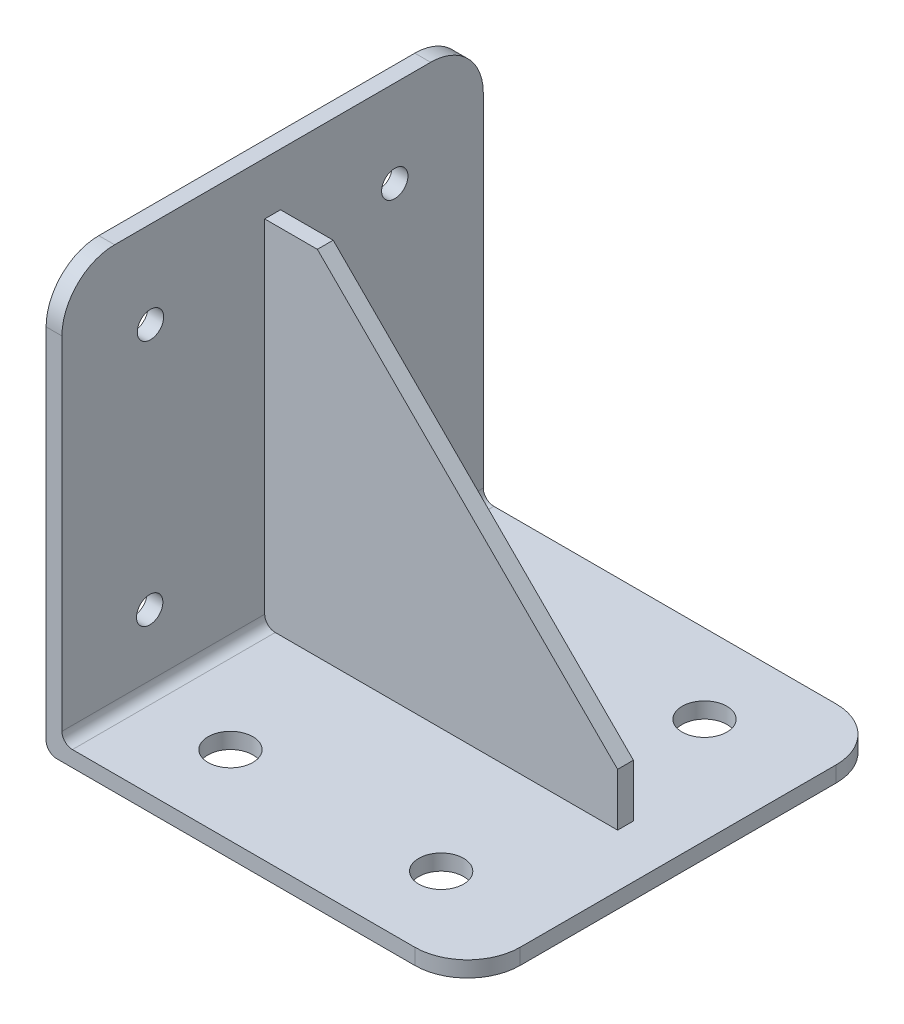
ISO-10303-21;
HEADER;
FILE_DESCRIPTION(('STEP AP214'),'2;1');
FILE_NAME('part.step','',(''),(''),'','','');
FILE_SCHEMA(('AUTOMOTIVE_DESIGN { 1 0 10303 214 1 1 1 1 }'));
ENDSEC;
DATA;
#1=APPLICATION_CONTEXT('core data for automotive mechanical design processes');
#2=APPLICATION_PROTOCOL_DEFINITION('international standard','automotive_design',2000,#1);
#3=PRODUCT_CONTEXT('',#1,'mechanical');
#4=PRODUCT('Part','Part','',(#3));
#5=PRODUCT_RELATED_PRODUCT_CATEGORY('part','',(#4));
#6=PRODUCT_DEFINITION_FORMATION('','',#4);
#7=PRODUCT_DEFINITION_CONTEXT('part definition',#1,'design');
#8=PRODUCT_DEFINITION('design','',#6,#7);
#9=PRODUCT_DEFINITION_SHAPE('','',#8);
#10=(LENGTH_UNIT() NAMED_UNIT(*) SI_UNIT(.MILLI.,.METRE.));
#11=(NAMED_UNIT(*) PLANE_ANGLE_UNIT() SI_UNIT($,.RADIAN.));
#12=(NAMED_UNIT(*) SI_UNIT($,.STERADIAN.) SOLID_ANGLE_UNIT());
#13=UNCERTAINTY_MEASURE_WITH_UNIT(LENGTH_MEASURE(1.E-05),#10,'distance_accuracy_value','');
#14=(GEOMETRIC_REPRESENTATION_CONTEXT(3) GLOBAL_UNCERTAINTY_ASSIGNED_CONTEXT((#13)) GLOBAL_UNIT_ASSIGNED_CONTEXT((#10,
#11,#12)) REPRESENTATION_CONTEXT('',''));
#15=CARTESIAN_POINT('',(0.,0.,0.));
#16=DIRECTION('',(0.,0.,1.));
#17=DIRECTION('',(1.,0.,0.));
#18=AXIS2_PLACEMENT_3D('',#15,#16,#17);
#19=CARTESIAN_POINT('',(-42.,45.,1.5));
#20=DIRECTION('',(0.707106781186548,0.707106781186548,0.));
#21=DIRECTION('',(-0.707106781186548,0.707106781186548,0.));
#22=AXIS2_PLACEMENT_3D('',#19,#20,#21);
#23=PLANE('',#22);
#24=DIRECTION('',(0.707106781186547,-0.707106781186548,0.));
#25=VECTOR('',#24,1.);
#26=CARTESIAN_POINT('',(-27.,30.,1.5));
#27=LINE('',#26,#25);
#28=CARTESIAN_POINT('',(-27.,30.,1.5));
#29=VERTEX_POINT('',#28);
#30=CARTESIAN_POINT('',(30.,-27.,1.5));
#31=VERTEX_POINT('',#30);
#32=EDGE_CURVE('E271',#29,#31,#27,.T.);
#33=ORIENTED_EDGE('',*,*,#32,.T.);
#34=DIRECTION('',(0.,0.,1.));
#35=VECTOR('',#34,1.);
#36=CARTESIAN_POINT('',(30.,-27.,-8.5));
#37=LINE('',#36,#35);
#38=CARTESIAN_POINT('',(30.,-27.,-1.5));
#39=VERTEX_POINT('',#38);
#40=EDGE_CURVE('E311',#31,#39,#37,.F.);
#41=ORIENTED_EDGE('',*,*,#40,.T.);
#42=DIRECTION('',(-0.707106781186547,0.707106781186548,0.));
#43=VECTOR('',#42,1.);
#44=CARTESIAN_POINT('',(30.,-27.,-1.5));
#45=LINE('',#44,#43);
#46=CARTESIAN_POINT('',(-27.,30.,-1.5));
#47=VERTEX_POINT('',#46);
#48=EDGE_CURVE('E308',#39,#47,#45,.T.);
#49=ORIENTED_EDGE('',*,*,#48,.T.);
#50=DIRECTION('',(0.,0.,-1.));
#51=VECTOR('',#50,1.);
#52=CARTESIAN_POINT('',(-27.,30.,-8.5));
#53=LINE('',#52,#51);
#54=EDGE_CURVE('E272',#47,#29,#53,.F.);
#55=ORIENTED_EDGE('',*,*,#54,.T.);
#56=EDGE_LOOP('',(#33,#41,#49,#55));
#57=FACE_BOUND('',#56,.T.);
#58=ADVANCED_FACE('F16',(#57),#23,.T.);
#59=CARTESIAN_POINT('',(30.,-37.,-8.5));
#60=DIRECTION('',(-1.,0.,0.));
#61=DIRECTION('',(0.,0.,1.));
#62=AXIS2_PLACEMENT_3D('',#59,#60,#61);
#63=PLANE('',#62);
#64=DIRECTION('',(0.,0.,-1.));
#65=VECTOR('',#64,1.);
#66=CARTESIAN_POINT('',(30.,-37.,-40.));
#67=LINE('',#66,#65);
#68=CARTESIAN_POINT('',(30.,-37.,1.5));
#69=VERTEX_POINT('',#68);
#70=CARTESIAN_POINT('',(30.,-37.,-1.5));
#71=VERTEX_POINT('',#70);
#72=EDGE_CURVE('E240',#69,#71,#67,.T.);
#73=ORIENTED_EDGE('',*,*,#72,.T.);
#74=DIRECTION('',(0.,1.,0.));
#75=VECTOR('',#74,1.);
#76=CARTESIAN_POINT('',(30.,-37.,-1.5));
#77=LINE('',#76,#75);
#78=EDGE_CURVE('E119',#71,#39,#77,.T.);
#79=ORIENTED_EDGE('',*,*,#78,.T.);
#80=ORIENTED_EDGE('',*,*,#40,.F.);
#81=DIRECTION('',(0.,1.,0.));
#82=VECTOR('',#81,1.);
#83=CARTESIAN_POINT('',(30.,-37.,1.5));
#84=LINE('',#83,#82);
#85=EDGE_CURVE('E291',#31,#69,#84,.F.);
#86=ORIENTED_EDGE('',*,*,#85,.T.);
#87=EDGE_LOOP('',(#73,#79,#80,#86));
#88=FACE_BOUND('',#87,.T.);
#89=ADVANCED_FACE('F455',(#88),#63,.F.);
#90=CARTESIAN_POINT('',(40.,40.,40.));
#91=DIRECTION('',(-1.,0.,0.));
#92=DIRECTION('',(0.,0.,1.));
#93=AXIS2_PLACEMENT_3D('',#90,#91,#92);
#94=PLANE('',#93);
#95=DIRECTION('',(0.,0.,1.));
#96=VECTOR('',#95,1.);
#97=CARTESIAN_POINT('',(40.,-40.,40.));
#98=LINE('',#97,#96);
#99=CARTESIAN_POINT('',(40.,-40.,30.));
#100=VERTEX_POINT('',#99);
#101=CARTESIAN_POINT('',(40.,-40.,-30.));
#102=VERTEX_POINT('',#101);
#103=EDGE_CURVE('E220',#100,#102,#98,.F.);
#104=ORIENTED_EDGE('',*,*,#103,.T.);
#105=DIRECTION('',(0.,1.,0.));
#106=VECTOR('',#105,1.);
#107=CARTESIAN_POINT('',(40.,40.,-30.));
#108=LINE('',#107,#106);
#109=CARTESIAN_POINT('',(40.,-37.,-30.));
#110=VERTEX_POINT('',#109);
#111=EDGE_CURVE('E289',#110,#102,#108,.F.);
#112=ORIENTED_EDGE('',*,*,#111,.F.);
#113=DIRECTION('',(0.,0.,-1.));
#114=VECTOR('',#113,1.);
#115=CARTESIAN_POINT('',(40.,-37.,-40.));
#116=LINE('',#115,#114);
#117=CARTESIAN_POINT('',(40.,-37.,30.));
#118=VERTEX_POINT('',#117);
#119=EDGE_CURVE('E244',#110,#118,#116,.F.);
#120=ORIENTED_EDGE('',*,*,#119,.T.);
#121=DIRECTION('',(0.,-1.,0.));
#122=VECTOR('',#121,1.);
#123=CARTESIAN_POINT('',(40.,-40.,30.));
#124=LINE('',#123,#122);
#125=EDGE_CURVE('E255',#100,#118,#124,.F.);
#126=ORIENTED_EDGE('',*,*,#125,.F.);
#127=EDGE_LOOP('',(#104,#112,#120,#126));
#128=FACE_BOUND('',#127,.T.);
#129=ADVANCED_FACE('F439',(#128),#94,.F.);
#130=CARTESIAN_POINT('',(20.,-40.,25.));
#131=DIRECTION('',(0.,1.,0.));
#132=DIRECTION('',(0.,0.,1.));
#133=AXIS2_PLACEMENT_3D('',#130,#131,#132);
#134=CYLINDRICAL_SURFACE('',#133,4.25);
#135=CARTESIAN_POINT('',(20.,-37.,25.));
#136=DIRECTION('',(0.,1.,0.));
#137=DIRECTION('',(0.,0.,1.));
#138=AXIS2_PLACEMENT_3D('',#135,#136,#137);
#139=CIRCLE('',#138,4.25);
#140=CARTESIAN_POINT('',(20.,-37.,29.25));
#141=VERTEX_POINT('',#140);
#142=EDGE_CURVE('E231',#141,#141,#139,.T.);
#143=ORIENTED_EDGE('',*,*,#142,.T.);
#144=EDGE_LOOP('',(#143));
#145=FACE_BOUND('',#144,.T.);
#146=CARTESIAN_POINT('',(20.,-40.,25.));
#147=DIRECTION('',(0.,1.,0.));
#148=DIRECTION('',(0.,0.,1.));
#149=AXIS2_PLACEMENT_3D('',#146,#147,#148);
#150=CIRCLE('',#149,4.25);
#151=CARTESIAN_POINT('',(20.,-40.,29.25));
#152=VERTEX_POINT('',#151);
#153=EDGE_CURVE('E215',#152,#152,#150,.F.);
#154=ORIENTED_EDGE('',*,*,#153,.T.);
#155=EDGE_LOOP('',(#154));
#156=FACE_BOUND('',#155,.T.);
#157=ADVANCED_FACE('F461',(#145,#156),#134,.F.);
#158=CARTESIAN_POINT('',(20.,-40.,-25.));
#159=DIRECTION('',(0.,1.,0.));
#160=DIRECTION('',(0.,0.,1.));
#161=AXIS2_PLACEMENT_3D('',#158,#159,#160);
#162=CYLINDRICAL_SURFACE('',#161,4.25);
#163=CARTESIAN_POINT('',(20.,-37.,-25.));
#164=DIRECTION('',(0.,1.,0.));
#165=DIRECTION('',(0.,0.,1.));
#166=AXIS2_PLACEMENT_3D('',#163,#164,#165);
#167=CIRCLE('',#166,4.25);
#168=CARTESIAN_POINT('',(20.,-37.,-20.75));
#169=VERTEX_POINT('',#168);
#170=EDGE_CURVE('E237',#169,#169,#167,.T.);
#171=ORIENTED_EDGE('',*,*,#170,.T.);
#172=EDGE_LOOP('',(#171));
#173=FACE_BOUND('',#172,.T.);
#174=CARTESIAN_POINT('',(20.,-40.,-25.));
#175=DIRECTION('',(0.,1.,0.));
#176=DIRECTION('',(0.,0.,1.));
#177=AXIS2_PLACEMENT_3D('',#174,#175,#176);
#178=CIRCLE('',#177,4.25);
#179=CARTESIAN_POINT('',(20.,-40.,-20.75));
#180=VERTEX_POINT('',#179);
#181=EDGE_CURVE('E212',#180,#180,#178,.F.);
#182=ORIENTED_EDGE('',*,*,#181,.T.);
#183=EDGE_LOOP('',(#182));
#184=FACE_BOUND('',#183,.T.);
#185=ADVANCED_FACE('F466',(#173,#184),#162,.F.);
#186=CARTESIAN_POINT('',(-20.,-40.,25.));
#187=DIRECTION('',(0.,1.,0.));
#188=DIRECTION('',(0.,0.,1.));
#189=AXIS2_PLACEMENT_3D('',#186,#187,#188);
#190=CYLINDRICAL_SURFACE('',#189,4.25);
#191=CARTESIAN_POINT('',(-20.,-37.,25.));
#192=DIRECTION('',(0.,1.,0.));
#193=DIRECTION('',(0.,0.,1.));
#194=AXIS2_PLACEMENT_3D('',#191,#192,#193);
#195=CIRCLE('',#194,4.25);
#196=CARTESIAN_POINT('',(-20.,-37.,29.25));
#197=VERTEX_POINT('',#196);
#198=EDGE_CURVE('E228',#197,#197,#195,.T.);
#199=ORIENTED_EDGE('',*,*,#198,.T.);
#200=EDGE_LOOP('',(#199));
#201=FACE_BOUND('',#200,.T.);
#202=CARTESIAN_POINT('',(-20.,-40.,25.));
#203=DIRECTION('',(0.,1.,0.));
#204=DIRECTION('',(0.,0.,1.));
#205=AXIS2_PLACEMENT_3D('',#202,#203,#204);
#206=CIRCLE('',#205,4.25);
#207=CARTESIAN_POINT('',(-20.,-40.,29.25));
#208=VERTEX_POINT('',#207);
#209=EDGE_CURVE('E209',#208,#208,#206,.F.);
#210=ORIENTED_EDGE('',*,*,#209,.T.);
#211=EDGE_LOOP('',(#210));
#212=FACE_BOUND('',#211,.T.);
#213=ADVANCED_FACE('F470',(#201,#212),#190,.F.);
#214=CARTESIAN_POINT('',(-20.,-40.,-25.));
#215=DIRECTION('',(0.,1.,0.));
#216=DIRECTION('',(0.,0.,1.));
#217=AXIS2_PLACEMENT_3D('',#214,#215,#216);
#218=CYLINDRICAL_SURFACE('',#217,4.25);
#219=CARTESIAN_POINT('',(-20.,-37.,-25.));
#220=DIRECTION('',(0.,1.,0.));
#221=DIRECTION('',(0.,0.,1.));
#222=AXIS2_PLACEMENT_3D('',#219,#220,#221);
#223=CIRCLE('',#222,4.25);
#224=CARTESIAN_POINT('',(-20.,-37.,-20.75));
#225=VERTEX_POINT('',#224);
#226=EDGE_CURVE('E234',#225,#225,#223,.T.);
#227=ORIENTED_EDGE('',*,*,#226,.T.);
#228=EDGE_LOOP('',(#227));
#229=FACE_BOUND('',#228,.T.);
#230=CARTESIAN_POINT('',(-20.,-40.,-25.));
#231=DIRECTION('',(0.,1.,0.));
#232=DIRECTION('',(0.,0.,1.));
#233=AXIS2_PLACEMENT_3D('',#230,#231,#232);
#234=CIRCLE('',#233,4.25);
#235=CARTESIAN_POINT('',(-20.,-40.,-20.75));
#236=VERTEX_POINT('',#235);
#237=EDGE_CURVE('E205',#236,#236,#234,.F.);
#238=ORIENTED_EDGE('',*,*,#237,.T.);
#239=EDGE_LOOP('',(#238));
#240=FACE_BOUND('',#239,.T.);
#241=ADVANCED_FACE('F474',(#229,#240),#218,.F.);
#242=CARTESIAN_POINT('',(60.,-37.,-1.5));
#243=DIRECTION('',(0.,0.,1.));
#244=DIRECTION('',(1.,0.,0.));
#245=AXIS2_PLACEMENT_3D('',#242,#243,#244);
#246=PLANE('',#245);
#247=DIRECTION('',(1.,0.,0.));
#248=VECTOR('',#247,1.);
#249=CARTESIAN_POINT('',(40.,-37.,-1.5));
#250=LINE('',#249,#248);
#251=CARTESIAN_POINT('',(-35.,-37.,-1.5));
#252=VERTEX_POINT('',#251);
#253=EDGE_CURVE('E252',#71,#252,#250,.F.);
#254=ORIENTED_EDGE('',*,*,#253,.T.);
#255=CARTESIAN_POINT('',(-35.,-35.,-1.5));
#256=DIRECTION('',(0.,0.,-1.));
#257=DIRECTION('',(-1.,0.,0.));
#258=AXIS2_PLACEMENT_3D('',#255,#256,#257);
#259=CIRCLE('',#258,2.);
#260=CARTESIAN_POINT('',(-37.,-35.,-1.5));
#261=VERTEX_POINT('',#260);
#262=EDGE_CURVE('E19',#252,#261,#259,.T.);
#263=ORIENTED_EDGE('',*,*,#262,.T.);
#264=DIRECTION('',(0.,1.,0.));
#265=VECTOR('',#264,1.);
#266=CARTESIAN_POINT('',(-37.,40.,-1.5));
#267=LINE('',#266,#265);
#268=CARTESIAN_POINT('',(-37.,30.,-1.5));
#269=VERTEX_POINT('',#268);
#270=EDGE_CURVE('E277',#261,#269,#267,.T.);
#271=ORIENTED_EDGE('',*,*,#270,.T.);
#272=DIRECTION('',(1.,0.,0.));
#273=VECTOR('',#272,1.);
#274=CARTESIAN_POINT('',(-37.,30.,-1.5));
#275=LINE('',#274,#273);
#276=EDGE_CURVE('E280',#269,#47,#275,.T.);
#277=ORIENTED_EDGE('',*,*,#276,.T.);
#278=ORIENTED_EDGE('',*,*,#48,.F.);
#279=ORIENTED_EDGE('',*,*,#78,.F.);
#280=EDGE_LOOP('',(#254,#263,#271,#277,#278,#279));
#281=FACE_BOUND('',#280,.T.);
#282=ADVANCED_FACE('F441',(#281),#246,.F.);
#283=CARTESIAN_POINT('',(-37.,30.,-8.5));
#284=DIRECTION('',(0.,-1.,0.));
#285=DIRECTION('',(0.,0.,-1.));
#286=AXIS2_PLACEMENT_3D('',#283,#284,#285);
#287=PLANE('',#286);
#288=ORIENTED_EDGE('',*,*,#54,.F.);
#289=ORIENTED_EDGE('',*,*,#276,.F.);
#290=DIRECTION('',(0.,0.,1.));
#291=VECTOR('',#290,1.);
#292=CARTESIAN_POINT('',(-37.,30.,-40.));
#293=LINE('',#292,#291);
#294=CARTESIAN_POINT('',(-37.,30.,1.5));
#295=VERTEX_POINT('',#294);
#296=EDGE_CURVE('E265',#269,#295,#293,.T.);
#297=ORIENTED_EDGE('',*,*,#296,.T.);
#298=DIRECTION('',(-1.,0.,0.));
#299=VECTOR('',#298,1.);
#300=CARTESIAN_POINT('',(60.,30.,1.5));
#301=LINE('',#300,#299);
#302=EDGE_CURVE('E268',#295,#29,#301,.F.);
#303=ORIENTED_EDGE('',*,*,#302,.T.);
#304=EDGE_LOOP('',(#288,#289,#297,#303));
#305=FACE_BOUND('',#304,.T.);
#306=ADVANCED_FACE('F453',(#305),#287,.F.);
#307=CARTESIAN_POINT('',(60.,-37.,1.5));
#308=DIRECTION('',(0.,0.,-1.));
#309=DIRECTION('',(-1.,0.,0.));
#310=AXIS2_PLACEMENT_3D('',#307,#308,#309);
#311=PLANE('',#310);
#312=ORIENTED_EDGE('',*,*,#32,.F.);
#313=ORIENTED_EDGE('',*,*,#302,.F.);
#314=DIRECTION('',(0.,1.,0.));
#315=VECTOR('',#314,1.);
#316=CARTESIAN_POINT('',(-37.,40.,1.5));
#317=LINE('',#316,#315);
#318=CARTESIAN_POINT('',(-37.,-35.,1.5));
#319=VERTEX_POINT('',#318);
#320=EDGE_CURVE('E261',#295,#319,#317,.F.);
#321=ORIENTED_EDGE('',*,*,#320,.T.);
#322=CARTESIAN_POINT('',(-35.,-35.,1.5));
#323=DIRECTION('',(0.,0.,-1.));
#324=DIRECTION('',(-1.,0.,0.));
#325=AXIS2_PLACEMENT_3D('',#322,#323,#324);
#326=CIRCLE('',#325,2.);
#327=CARTESIAN_POINT('',(-35.,-37.,1.5));
#328=VERTEX_POINT('',#327);
#329=EDGE_CURVE('E225',#319,#328,#326,.F.);
#330=ORIENTED_EDGE('',*,*,#329,.T.);
#331=DIRECTION('',(1.,0.,0.));
#332=VECTOR('',#331,1.);
#333=CARTESIAN_POINT('',(40.,-37.,1.5));
#334=LINE('',#333,#332);
#335=EDGE_CURVE('E243',#328,#69,#334,.T.);
#336=ORIENTED_EDGE('',*,*,#335,.T.);
#337=ORIENTED_EDGE('',*,*,#85,.F.);
#338=EDGE_LOOP('',(#312,#313,#321,#330,#336,#337));
#339=FACE_BOUND('',#338,.T.);
#340=ADVANCED_FACE('F452',(#339),#311,.F.);
#341=CARTESIAN_POINT('',(30.,40.,-30.));
#342=DIRECTION('',(0.,1.,0.));
#343=DIRECTION('',(0.,0.,1.));
#344=AXIS2_PLACEMENT_3D('',#341,#342,#343);
#345=CYLINDRICAL_SURFACE('',#344,10.);
#346=ORIENTED_EDGE('',*,*,#111,.T.);
#347=CARTESIAN_POINT('',(30.,-40.,-30.));
#348=DIRECTION('',(0.,1.,0.));
#349=DIRECTION('',(0.,0.,1.));
#350=AXIS2_PLACEMENT_3D('',#347,#348,#349);
#351=CIRCLE('',#350,10.);
#352=CARTESIAN_POINT('',(30.,-40.,-40.));
#353=VERTEX_POINT('',#352);
#354=EDGE_CURVE('E218',#102,#353,#351,.T.);
#355=ORIENTED_EDGE('',*,*,#354,.T.);
#356=DIRECTION('',(0.,1.,0.));
#357=VECTOR('',#356,1.);
#358=CARTESIAN_POINT('',(30.,-40.,-40.));
#359=LINE('',#358,#357);
#360=CARTESIAN_POINT('',(30.,-37.,-40.));
#361=VERTEX_POINT('',#360);
#362=EDGE_CURVE('E259',#353,#361,#359,.T.);
#363=ORIENTED_EDGE('',*,*,#362,.T.);
#364=CARTESIAN_POINT('',(30.,-37.,-30.));
#365=DIRECTION('',(0.,1.,0.));
#366=DIRECTION('',(0.,0.,1.));
#367=AXIS2_PLACEMENT_3D('',#364,#365,#366);
#368=CIRCLE('',#367,10.);
#369=EDGE_CURVE('E245',#361,#110,#368,.F.);
#370=ORIENTED_EDGE('',*,*,#369,.T.);
#371=EDGE_LOOP('',(#346,#355,#363,#370));
#372=FACE_BOUND('',#371,.T.);
#373=ADVANCED_FACE('F437',(#372),#345,.T.);
#374=CARTESIAN_POINT('',(-35.,-35.,-40.));
#375=DIRECTION('',(0.,0.,-1.));
#376=DIRECTION('',(-1.,0.,0.));
#377=AXIS2_PLACEMENT_3D('',#374,#375,#376);
#378=CYLINDRICAL_SURFACE('',#377,2.);
#379=ORIENTED_EDGE('',*,*,#262,.F.);
#380=DIRECTION('',(0.,0.,-1.));
#381=VECTOR('',#380,1.);
#382=CARTESIAN_POINT('',(-35.,-37.,-40.));
#383=LINE('',#382,#381);
#384=CARTESIAN_POINT('',(-35.,-37.,-40.));
#385=VERTEX_POINT('',#384);
#386=EDGE_CURVE('E247',#252,#385,#383,.T.);
#387=ORIENTED_EDGE('',*,*,#386,.T.);
#388=CARTESIAN_POINT('',(-35.,-35.,-40.));
#389=DIRECTION('',(0.,0.,-1.));
#390=DIRECTION('',(-1.,0.,0.));
#391=AXIS2_PLACEMENT_3D('',#388,#389,#390);
#392=CIRCLE('',#391,2.);
#393=CARTESIAN_POINT('',(-37.,-35.,-40.));
#394=VERTEX_POINT('',#393);
#395=EDGE_CURVE('E200',#385,#394,#392,.T.);
#396=ORIENTED_EDGE('',*,*,#395,.T.);
#397=DIRECTION('',(0.,0.,1.));
#398=VECTOR('',#397,1.);
#399=CARTESIAN_POINT('',(-37.,-35.,-40.));
#400=LINE('',#399,#398);
#401=EDGE_CURVE('E208',#394,#261,#400,.T.);
#402=ORIENTED_EDGE('',*,*,#401,.T.);
#403=EDGE_LOOP('',(#379,#387,#396,#402));
#404=FACE_BOUND('',#403,.T.);
#405=ADVANCED_FACE('F360',(#404),#378,.F.);
#406=CARTESIAN_POINT('',(30.,-40.,30.));
#407=DIRECTION('',(0.,-1.,0.));
#408=DIRECTION('',(0.,0.,-1.));
#409=AXIS2_PLACEMENT_3D('',#406,#407,#408);
#410=CYLINDRICAL_SURFACE('',#409,10.);
#411=DIRECTION('',(0.,1.,0.));
#412=VECTOR('',#411,1.);
#413=CARTESIAN_POINT('',(30.,-40.,40.));
#414=LINE('',#413,#412);
#415=CARTESIAN_POINT('',(30.,-40.,40.));
#416=VERTEX_POINT('',#415);
#417=CARTESIAN_POINT('',(30.,-37.,40.));
#418=VERTEX_POINT('',#417);
#419=EDGE_CURVE('E358',#416,#418,#414,.T.);
#420=ORIENTED_EDGE('',*,*,#419,.F.);
#421=CARTESIAN_POINT('',(30.,-40.,30.));
#422=DIRECTION('',(0.,-1.,0.));
#423=DIRECTION('',(0.,0.,-1.));
#424=AXIS2_PLACEMENT_3D('',#421,#422,#423);
#425=CIRCLE('',#424,10.);
#426=EDGE_CURVE('E221',#416,#100,#425,.F.);
#427=ORIENTED_EDGE('',*,*,#426,.T.);
#428=ORIENTED_EDGE('',*,*,#125,.T.);
#429=CARTESIAN_POINT('',(30.,-37.,30.));
#430=DIRECTION('',(0.,-1.,0.));
#431=DIRECTION('',(0.,0.,-1.));
#432=AXIS2_PLACEMENT_3D('',#429,#430,#431);
#433=CIRCLE('',#432,10.);
#434=EDGE_CURVE('E241',#118,#418,#433,.T.);
#435=ORIENTED_EDGE('',*,*,#434,.T.);
#436=EDGE_LOOP('',(#420,#427,#428,#435));
#437=FACE_BOUND('',#436,.T.);
#438=ADVANCED_FACE('F384',(#437),#410,.T.);
#439=CARTESIAN_POINT('',(40.,-37.,-40.));
#440=DIRECTION('',(0.,-1.,0.));
#441=DIRECTION('',(0.,0.,-1.));
#442=AXIS2_PLACEMENT_3D('',#439,#440,#441);
#443=PLANE('',#442);
#444=ORIENTED_EDGE('',*,*,#198,.F.);
#445=EDGE_LOOP('',(#444));
#446=FACE_BOUND('',#445,.T.);
#447=ORIENTED_EDGE('',*,*,#142,.F.);
#448=EDGE_LOOP('',(#447));
#449=FACE_BOUND('',#448,.T.);
#450=ORIENTED_EDGE('',*,*,#226,.F.);
#451=EDGE_LOOP('',(#450));
#452=FACE_BOUND('',#451,.T.);
#453=ORIENTED_EDGE('',*,*,#170,.F.);
#454=EDGE_LOOP('',(#453));
#455=FACE_BOUND('',#454,.T.);
#456=ORIENTED_EDGE('',*,*,#335,.F.);
#457=DIRECTION('',(0.,0.,-1.));
#458=VECTOR('',#457,1.);
#459=CARTESIAN_POINT('',(-35.,-37.,-40.));
#460=LINE('',#459,#458);
#461=CARTESIAN_POINT('',(-35.,-37.,40.));
#462=VERTEX_POINT('',#461);
#463=EDGE_CURVE('E224',#328,#462,#460,.F.);
#464=ORIENTED_EDGE('',*,*,#463,.T.);
#465=DIRECTION('',(1.,0.,0.));
#466=VECTOR('',#465,1.);
#467=CARTESIAN_POINT('',(40.,-37.,40.));
#468=LINE('',#467,#466);
#469=EDGE_CURVE('E193',#418,#462,#468,.F.);
#470=ORIENTED_EDGE('',*,*,#469,.F.);
#471=ORIENTED_EDGE('',*,*,#434,.F.);
#472=ORIENTED_EDGE('',*,*,#119,.F.);
#473=ORIENTED_EDGE('',*,*,#369,.F.);
#474=DIRECTION('',(1.,0.,0.));
#475=VECTOR('',#474,1.);
#476=CARTESIAN_POINT('',(40.,-37.,-40.));
#477=LINE('',#476,#475);
#478=EDGE_CURVE('E204',#361,#385,#477,.F.);
#479=ORIENTED_EDGE('',*,*,#478,.T.);
#480=ORIENTED_EDGE('',*,*,#386,.F.);
#481=ORIENTED_EDGE('',*,*,#253,.F.);
#482=ORIENTED_EDGE('',*,*,#72,.F.);
#483=EDGE_LOOP('',(#456,#464,#470,#471,#472,#473,#479,#480,#481,#482));
#484=FACE_BOUND('',#483,.T.);
#485=ADVANCED_FACE('F389',(#446,#449,#452,#455,#484),#443,.F.);
#486=CARTESIAN_POINT('',(-35.,-35.,-40.));
#487=DIRECTION('',(0.,0.,-1.));
#488=DIRECTION('',(-1.,0.,0.));
#489=AXIS2_PLACEMENT_3D('',#486,#487,#488);
#490=CYLINDRICAL_SURFACE('',#489,2.);
#491=CARTESIAN_POINT('',(-35.,-35.,40.));
#492=DIRECTION('',(0.,0.,-1.));
#493=DIRECTION('',(-1.,0.,0.));
#494=AXIS2_PLACEMENT_3D('',#491,#492,#493);
#495=CIRCLE('',#494,2.);
#496=CARTESIAN_POINT('',(-37.,-35.,40.));
#497=VERTEX_POINT('',#496);
#498=EDGE_CURVE('E190',#462,#497,#495,.T.);
#499=ORIENTED_EDGE('',*,*,#498,.F.);
#500=ORIENTED_EDGE('',*,*,#463,.F.);
#501=ORIENTED_EDGE('',*,*,#329,.F.);
#502=DIRECTION('',(0.,0.,1.));
#503=VECTOR('',#502,1.);
#504=CARTESIAN_POINT('',(-37.,-35.,-40.));
#505=LINE('',#504,#503);
#506=EDGE_CURVE('E264',#319,#497,#505,.T.);
#507=ORIENTED_EDGE('',*,*,#506,.T.);
#508=EDGE_LOOP('',(#499,#500,#501,#507));
#509=FACE_BOUND('',#508,.T.);
#510=ADVANCED_FACE('F394',(#509),#490,.F.);
#511=CARTESIAN_POINT('',(-40.,-40.,40.));
#512=DIRECTION('',(0.,1.,0.));
#513=DIRECTION('',(0.,0.,1.));
#514=AXIS2_PLACEMENT_3D('',#511,#512,#513);
#515=PLANE('',#514);
#516=ORIENTED_EDGE('',*,*,#237,.F.);
#517=EDGE_LOOP('',(#516));
#518=FACE_BOUND('',#517,.T.);
#519=ORIENTED_EDGE('',*,*,#209,.F.);
#520=EDGE_LOOP('',(#519));
#521=FACE_BOUND('',#520,.T.);
#522=ORIENTED_EDGE('',*,*,#181,.F.);
#523=EDGE_LOOP('',(#522));
#524=FACE_BOUND('',#523,.T.);
#525=ORIENTED_EDGE('',*,*,#153,.F.);
#526=EDGE_LOOP('',(#525));
#527=FACE_BOUND('',#526,.T.);
#528=DIRECTION('',(1.,0.,0.));
#529=VECTOR('',#528,1.);
#530=CARTESIAN_POINT('',(40.,-40.,-40.));
#531=LINE('',#530,#529);
#532=CARTESIAN_POINT('',(-38.,-40.,-40.));
#533=VERTEX_POINT('',#532);
#534=EDGE_CURVE('E348',#533,#353,#531,.T.);
#535=ORIENTED_EDGE('',*,*,#534,.T.);
#536=ORIENTED_EDGE('',*,*,#354,.F.);
#537=ORIENTED_EDGE('',*,*,#103,.F.);
#538=ORIENTED_EDGE('',*,*,#426,.F.);
#539=DIRECTION('',(1.,0.,0.));
#540=VECTOR('',#539,1.);
#541=CARTESIAN_POINT('',(40.,-40.,40.));
#542=LINE('',#541,#540);
#543=CARTESIAN_POINT('',(-38.,-40.,40.));
#544=VERTEX_POINT('',#543);
#545=EDGE_CURVE('E197',#544,#416,#542,.T.);
#546=ORIENTED_EDGE('',*,*,#545,.F.);
#547=DIRECTION('',(0.,0.,-1.));
#548=VECTOR('',#547,1.);
#549=CARTESIAN_POINT('',(-38.,-40.,40.));
#550=LINE('',#549,#548);
#551=EDGE_CURVE('E185',#533,#544,#550,.F.);
#552=ORIENTED_EDGE('',*,*,#551,.F.);
#553=EDGE_LOOP('',(#535,#536,#537,#538,#546,#552));
#554=FACE_BOUND('',#553,.T.);
#555=ADVANCED_FACE('F433',(#518,#521,#524,#527,#554),#515,.F.);
#556=CARTESIAN_POINT('',(-37.,40.,-40.));
#557=DIRECTION('',(-1.,0.,0.));
#558=DIRECTION('',(0.,0.,1.));
#559=AXIS2_PLACEMENT_3D('',#556,#557,#558);
#560=PLANE('',#559);
#561=CARTESIAN_POINT('',(-37.,-23.33452377916,23.33452377916));
#562=DIRECTION('',(-1.,0.,0.));
#563=DIRECTION('',(0.,0.,1.));
#564=AXIS2_PLACEMENT_3D('',#561,#562,#563);
#565=CIRCLE('',#564,2.5);
#566=CARTESIAN_POINT('',(-37.,-23.33452377916,25.83452377916));
#567=VERTEX_POINT('',#566);
#568=EDGE_CURVE('E175',#567,#567,#565,.T.);
#569=ORIENTED_EDGE('',*,*,#568,.T.);
#570=EDGE_LOOP('',(#569));
#571=FACE_BOUND('',#570,.T.);
#572=CARTESIAN_POINT('',(-37.,23.47767630506,23.19048760408));
#573=DIRECTION('',(-1.,0.,0.));
#574=DIRECTION('',(0.,0.,1.));
#575=AXIS2_PLACEMENT_3D('',#572,#573,#574);
#576=CIRCLE('',#575,2.5);
#577=CARTESIAN_POINT('',(-37.,23.47767630506,25.69048760408));
#578=VERTEX_POINT('',#577);
#579=EDGE_CURVE('E178',#578,#578,#576,.T.);
#580=ORIENTED_EDGE('',*,*,#579,.T.);
#581=EDGE_LOOP('',(#580));
#582=FACE_BOUND('',#581,.T.);
#583=CARTESIAN_POINT('',(-37.,-23.33452377916,-23.33452377916));
#584=DIRECTION('',(-1.,0.,0.));
#585=DIRECTION('',(0.,0.,1.));
#586=AXIS2_PLACEMENT_3D('',#583,#584,#585);
#587=CIRCLE('',#586,2.5);
#588=CARTESIAN_POINT('',(-37.,-23.33452377916,-20.83452377916));
#589=VERTEX_POINT('',#588);
#590=EDGE_CURVE('E168',#589,#589,#587,.T.);
#591=ORIENTED_EDGE('',*,*,#590,.T.);
#592=EDGE_LOOP('',(#591));
#593=FACE_BOUND('',#592,.T.);
#594=CARTESIAN_POINT('',(-37.,23.47767630506,-23.19048760408));
#595=DIRECTION('',(-1.,0.,0.));
#596=DIRECTION('',(0.,0.,1.));
#597=AXIS2_PLACEMENT_3D('',#594,#595,#596);
#598=CIRCLE('',#597,2.5);
#599=CARTESIAN_POINT('',(-37.,23.47767630506,-20.69048760408));
#600=VERTEX_POINT('',#599);
#601=EDGE_CURVE('E181',#600,#600,#598,.T.);
#602=ORIENTED_EDGE('',*,*,#601,.T.);
#603=EDGE_LOOP('',(#602));
#604=FACE_BOUND('',#603,.T.);
#605=CARTESIAN_POINT('',(-37.,30.,30.));
#606=DIRECTION('',(1.,0.,0.));
#607=DIRECTION('',(0.,0.,-1.));
#608=AXIS2_PLACEMENT_3D('',#605,#606,#607);
#609=CIRCLE('',#608,10.);
#610=CARTESIAN_POINT('',(-37.,30.,40.));
#611=VERTEX_POINT('',#610);
#612=CARTESIAN_POINT('',(-37.,40.,30.));
#613=VERTEX_POINT('',#612);
#614=EDGE_CURVE('E194',#611,#613,#609,.F.);
#615=ORIENTED_EDGE('',*,*,#614,.F.);
#616=DIRECTION('',(0.,1.,0.));
#617=VECTOR('',#616,1.);
#618=CARTESIAN_POINT('',(-37.,-40.,40.));
#619=LINE('',#618,#617);
#620=EDGE_CURVE('E192',#497,#611,#619,.T.);
#621=ORIENTED_EDGE('',*,*,#620,.F.);
#622=ORIENTED_EDGE('',*,*,#506,.F.);
#623=ORIENTED_EDGE('',*,*,#320,.F.);
#624=ORIENTED_EDGE('',*,*,#296,.F.);
#625=ORIENTED_EDGE('',*,*,#270,.F.);
#626=ORIENTED_EDGE('',*,*,#401,.F.);
#627=DIRECTION('',(0.,1.,0.));
#628=VECTOR('',#627,1.);
#629=CARTESIAN_POINT('',(-37.,-40.,-40.));
#630=LINE('',#629,#628);
#631=CARTESIAN_POINT('',(-37.,30.,-40.));
#632=VERTEX_POINT('',#631);
#633=EDGE_CURVE('E203',#394,#632,#630,.T.);
#634=ORIENTED_EDGE('',*,*,#633,.T.);
#635=CARTESIAN_POINT('',(-37.,30.,-30.));
#636=DIRECTION('',(-1.,0.,0.));
#637=DIRECTION('',(0.,0.,1.));
#638=AXIS2_PLACEMENT_3D('',#635,#636,#637);
#639=CIRCLE('',#638,10.);
#640=CARTESIAN_POINT('',(-37.,40.,-30.));
#641=VERTEX_POINT('',#640);
#642=EDGE_CURVE('E198',#641,#632,#639,.T.);
#643=ORIENTED_EDGE('',*,*,#642,.F.);
#644=DIRECTION('',(0.,0.,-1.));
#645=VECTOR('',#644,1.);
#646=CARTESIAN_POINT('',(-37.,40.,40.));
#647=LINE('',#646,#645);
#648=EDGE_CURVE('E146',#641,#613,#647,.F.);
#649=ORIENTED_EDGE('',*,*,#648,.T.);
#650=EDGE_LOOP('',(#615,#621,#622,#623,#624,#625,#626,#634,#643,#649));
#651=FACE_BOUND('',#650,.T.);
#652=ADVANCED_FACE('F365',(#571,#582,#593,#604,#651),#560,.F.);
#653=CARTESIAN_POINT('',(40.,-40.,-40.));
#654=DIRECTION('',(0.,0.,1.));
#655=DIRECTION('',(1.,0.,0.));
#656=AXIS2_PLACEMENT_3D('',#653,#654,#655);
#657=PLANE('',#656);
#658=DIRECTION('',(0.,1.,0.));
#659=VECTOR('',#658,1.);
#660=CARTESIAN_POINT('',(-40.,40.,-40.));
#661=LINE('',#660,#659);
#662=CARTESIAN_POINT('',(-40.,-38.,-40.));
#663=VERTEX_POINT('',#662);
#664=CARTESIAN_POINT('',(-40.,30.,-40.));
#665=VERTEX_POINT('',#664);
#666=EDGE_CURVE('E166',#663,#665,#661,.T.);
#667=ORIENTED_EDGE('',*,*,#666,.T.);
#668=DIRECTION('',(-1.,0.,0.));
#669=VECTOR('',#668,1.);
#670=CARTESIAN_POINT('',(-40.,30.,-40.));
#671=LINE('',#670,#669);
#672=EDGE_CURVE('E165',#632,#665,#671,.T.);
#673=ORIENTED_EDGE('',*,*,#672,.F.);
#674=ORIENTED_EDGE('',*,*,#633,.F.);
#675=ORIENTED_EDGE('',*,*,#395,.F.);
#676=ORIENTED_EDGE('',*,*,#478,.F.);
#677=ORIENTED_EDGE('',*,*,#362,.F.);
#678=ORIENTED_EDGE('',*,*,#534,.F.);
#679=CARTESIAN_POINT('',(-38.,-38.,-40.));
#680=DIRECTION('',(0.,0.,-1.));
#681=DIRECTION('',(-1.,0.,0.));
#682=AXIS2_PLACEMENT_3D('',#679,#680,#681);
#683=CIRCLE('',#682,2.);
#684=EDGE_CURVE('E186',#663,#533,#683,.F.);
#685=ORIENTED_EDGE('',*,*,#684,.F.);
#686=EDGE_LOOP('',(#667,#673,#674,#675,#676,#677,#678,#685));
#687=FACE_BOUND('',#686,.T.);
#688=ADVANCED_FACE('F368',(#687),#657,.F.);
#689=CARTESIAN_POINT('',(-40.,30.,-30.));
#690=DIRECTION('',(-1.,0.,0.));
#691=DIRECTION('',(0.,0.,1.));
#692=AXIS2_PLACEMENT_3D('',#689,#690,#691);
#693=CYLINDRICAL_SURFACE('',#692,10.);
#694=DIRECTION('',(1.,0.,0.));
#695=VECTOR('',#694,1.);
#696=CARTESIAN_POINT('',(-40.,40.,-30.));
#697=LINE('',#696,#695);
#698=CARTESIAN_POINT('',(-40.,40.,-30.));
#699=VERTEX_POINT('',#698);
#700=EDGE_CURVE('E141',#699,#641,#697,.T.);
#701=ORIENTED_EDGE('',*,*,#700,.T.);
#702=ORIENTED_EDGE('',*,*,#642,.T.);
#703=ORIENTED_EDGE('',*,*,#672,.T.);
#704=CARTESIAN_POINT('',(-40.,30.,-30.));
#705=DIRECTION('',(-1.,0.,0.));
#706=DIRECTION('',(0.,0.,1.));
#707=AXIS2_PLACEMENT_3D('',#704,#705,#706);
#708=CIRCLE('',#707,10.);
#709=EDGE_CURVE('E158',#665,#699,#708,.F.);
#710=ORIENTED_EDGE('',*,*,#709,.T.);
#711=EDGE_LOOP('',(#701,#702,#703,#710));
#712=FACE_BOUND('',#711,.T.);
#713=ADVANCED_FACE('F163',(#712),#693,.T.);
#714=CARTESIAN_POINT('',(-40.,40.,40.));
#715=DIRECTION('',(0.,-1.,0.));
#716=DIRECTION('',(0.,0.,-1.));
#717=AXIS2_PLACEMENT_3D('',#714,#715,#716);
#718=PLANE('',#717);
#719=DIRECTION('',(0.,0.,-1.));
#720=VECTOR('',#719,1.);
#721=CARTESIAN_POINT('',(-40.,40.,40.));
#722=LINE('',#721,#720);
#723=CARTESIAN_POINT('',(-40.,40.,30.));
#724=VERTEX_POINT('',#723);
#725=EDGE_CURVE('E145',#699,#724,#722,.F.);
#726=ORIENTED_EDGE('',*,*,#725,.T.);
#727=DIRECTION('',(1.,0.,0.));
#728=VECTOR('',#727,1.);
#729=CARTESIAN_POINT('',(40.,40.,30.));
#730=LINE('',#729,#728);
#731=EDGE_CURVE('E151',#613,#724,#730,.F.);
#732=ORIENTED_EDGE('',*,*,#731,.F.);
#733=ORIENTED_EDGE('',*,*,#648,.F.);
#734=ORIENTED_EDGE('',*,*,#700,.F.);
#735=EDGE_LOOP('',(#726,#732,#733,#734));
#736=FACE_BOUND('',#735,.T.);
#737=ADVANCED_FACE('F143',(#736),#718,.F.);
#738=CARTESIAN_POINT('',(40.,30.,30.));
#739=DIRECTION('',(1.,0.,0.));
#740=DIRECTION('',(0.,0.,-1.));
#741=AXIS2_PLACEMENT_3D('',#738,#739,#740);
#742=CYLINDRICAL_SURFACE('',#741,10.);
#743=DIRECTION('',(1.,0.,0.));
#744=VECTOR('',#743,1.);
#745=CARTESIAN_POINT('',(40.,30.,40.));
#746=LINE('',#745,#744);
#747=CARTESIAN_POINT('',(-40.,30.,40.));
#748=VERTEX_POINT('',#747);
#749=EDGE_CURVE('E189',#611,#748,#746,.F.);
#750=ORIENTED_EDGE('',*,*,#749,.F.);
#751=ORIENTED_EDGE('',*,*,#614,.T.);
#752=ORIENTED_EDGE('',*,*,#731,.T.);
#753=CARTESIAN_POINT('',(-40.,30.,30.));
#754=DIRECTION('',(1.,0.,0.));
#755=DIRECTION('',(0.,0.,-1.));
#756=AXIS2_PLACEMENT_3D('',#753,#754,#755);
#757=CIRCLE('',#756,10.);
#758=EDGE_CURVE('E161',#724,#748,#757,.T.);
#759=ORIENTED_EDGE('',*,*,#758,.T.);
#760=EDGE_LOOP('',(#750,#751,#752,#759));
#761=FACE_BOUND('',#760,.T.);
#762=ADVANCED_FACE('F396',(#761),#742,.T.);
#763=CARTESIAN_POINT('',(40.,-40.,40.));
#764=DIRECTION('',(0.,0.,1.));
#765=DIRECTION('',(1.,0.,0.));
#766=AXIS2_PLACEMENT_3D('',#763,#764,#765);
#767=PLANE('',#766);
#768=ORIENTED_EDGE('',*,*,#749,.T.);
#769=DIRECTION('',(0.,1.,0.));
#770=VECTOR('',#769,1.);
#771=CARTESIAN_POINT('',(-40.,40.,40.));
#772=LINE('',#771,#770);
#773=CARTESIAN_POINT('',(-40.,-38.,40.));
#774=VERTEX_POINT('',#773);
#775=EDGE_CURVE('E336',#748,#774,#772,.F.);
#776=ORIENTED_EDGE('',*,*,#775,.T.);
#777=CARTESIAN_POINT('',(-38.,-38.,40.));
#778=DIRECTION('',(0.,0.,-1.));
#779=DIRECTION('',(-1.,0.,0.));
#780=AXIS2_PLACEMENT_3D('',#777,#778,#779);
#781=CIRCLE('',#780,2.);
#782=EDGE_CURVE('E34',#544,#774,#781,.T.);
#783=ORIENTED_EDGE('',*,*,#782,.F.);
#784=ORIENTED_EDGE('',*,*,#545,.T.);
#785=ORIENTED_EDGE('',*,*,#419,.T.);
#786=ORIENTED_EDGE('',*,*,#469,.T.);
#787=ORIENTED_EDGE('',*,*,#498,.T.);
#788=ORIENTED_EDGE('',*,*,#620,.T.);
#789=EDGE_LOOP('',(#768,#776,#783,#784,#785,#786,#787,#788));
#790=FACE_BOUND('',#789,.T.);
#791=ADVANCED_FACE('F372',(#790),#767,.T.);
#792=CARTESIAN_POINT('',(-38.,-38.,40.));
#793=DIRECTION('',(0.,0.,-1.));
#794=DIRECTION('',(-1.,0.,0.));
#795=AXIS2_PLACEMENT_3D('',#792,#793,#794);
#796=CYLINDRICAL_SURFACE('',#795,2.);
#797=ORIENTED_EDGE('',*,*,#551,.T.);
#798=ORIENTED_EDGE('',*,*,#782,.T.);
#799=DIRECTION('',(0.,0.,-1.));
#800=VECTOR('',#799,1.);
#801=CARTESIAN_POINT('',(-40.,-38.,40.));
#802=LINE('',#801,#800);
#803=EDGE_CURVE('E333',#774,#663,#802,.T.);
#804=ORIENTED_EDGE('',*,*,#803,.T.);
#805=ORIENTED_EDGE('',*,*,#684,.T.);
#806=EDGE_LOOP('',(#797,#798,#804,#805));
#807=FACE_BOUND('',#806,.T.);
#808=ADVANCED_FACE('F404',(#807),#796,.T.);
#809=CARTESIAN_POINT('',(-40.,23.47767630506,-23.19048760408));
#810=DIRECTION('',(-1.,0.,0.));
#811=DIRECTION('',(0.,0.,1.));
#812=AXIS2_PLACEMENT_3D('',#809,#810,#811);
#813=CYLINDRICAL_SURFACE('',#812,2.5);
#814=CARTESIAN_POINT('',(-40.,23.47767630506,-23.19048760408));
#815=DIRECTION('',(-1.,0.,0.));
#816=DIRECTION('',(0.,0.,1.));
#817=AXIS2_PLACEMENT_3D('',#814,#815,#816);
#818=CIRCLE('',#817,2.5);
#819=CARTESIAN_POINT('',(-40.,23.47767630506,-20.69048760408));
#820=VERTEX_POINT('',#819);
#821=EDGE_CURVE('E331',#820,#820,#818,.T.);
#822=ORIENTED_EDGE('',*,*,#821,.T.);
#823=EDGE_LOOP('',(#822));
#824=FACE_BOUND('',#823,.T.);
#825=ORIENTED_EDGE('',*,*,#601,.F.);
#826=EDGE_LOOP('',(#825));
#827=FACE_BOUND('',#826,.T.);
#828=ADVANCED_FACE('F426',(#824,#827),#813,.F.);
#829=CARTESIAN_POINT('',(-40.,23.47767630506,23.19048760408));
#830=DIRECTION('',(-1.,0.,0.));
#831=DIRECTION('',(0.,0.,1.));
#832=AXIS2_PLACEMENT_3D('',#829,#830,#831);
#833=CYLINDRICAL_SURFACE('',#832,2.5);
#834=CARTESIAN_POINT('',(-40.,23.47767630506,23.19048760408));
#835=DIRECTION('',(-1.,0.,0.));
#836=DIRECTION('',(0.,0.,1.));
#837=AXIS2_PLACEMENT_3D('',#834,#835,#836);
#838=CIRCLE('',#837,2.5);
#839=CARTESIAN_POINT('',(-40.,23.47767630506,25.69048760408));
#840=VERTEX_POINT('',#839);
#841=EDGE_CURVE('E329',#840,#840,#838,.T.);
#842=ORIENTED_EDGE('',*,*,#841,.T.);
#843=EDGE_LOOP('',(#842));
#844=FACE_BOUND('',#843,.T.);
#845=ORIENTED_EDGE('',*,*,#579,.F.);
#846=EDGE_LOOP('',(#845));
#847=FACE_BOUND('',#846,.T.);
#848=ADVANCED_FACE('F422',(#844,#847),#833,.F.);
#849=CARTESIAN_POINT('',(-40.,-23.33452377916,23.33452377916));
#850=DIRECTION('',(-1.,0.,0.));
#851=DIRECTION('',(0.,0.,1.));
#852=AXIS2_PLACEMENT_3D('',#849,#850,#851);
#853=CYLINDRICAL_SURFACE('',#852,2.5);
#854=CARTESIAN_POINT('',(-40.,-23.33452377916,23.33452377916));
#855=DIRECTION('',(-1.,0.,0.));
#856=DIRECTION('',(0.,0.,1.));
#857=AXIS2_PLACEMENT_3D('',#854,#855,#856);
#858=CIRCLE('',#857,2.5);
#859=CARTESIAN_POINT('',(-40.,-23.33452377916,25.83452377916));
#860=VERTEX_POINT('',#859);
#861=EDGE_CURVE('E25',#860,#860,#858,.T.);
#862=ORIENTED_EDGE('',*,*,#861,.T.);
#863=EDGE_LOOP('',(#862));
#864=FACE_BOUND('',#863,.T.);
#865=ORIENTED_EDGE('',*,*,#568,.F.);
#866=EDGE_LOOP('',(#865));
#867=FACE_BOUND('',#866,.T.);
#868=ADVANCED_FACE('F414',(#864,#867),#853,.F.);
#869=CARTESIAN_POINT('',(-40.,-23.33452377916,-23.33452377916));
#870=DIRECTION('',(-1.,0.,0.));
#871=DIRECTION('',(0.,0.,1.));
#872=AXIS2_PLACEMENT_3D('',#869,#870,#871);
#873=CYLINDRICAL_SURFACE('',#872,2.5);
#874=CARTESIAN_POINT('',(-40.,-23.33452377916,-23.33452377916));
#875=DIRECTION('',(-1.,0.,0.));
#876=DIRECTION('',(0.,0.,1.));
#877=AXIS2_PLACEMENT_3D('',#874,#875,#876);
#878=CIRCLE('',#877,2.5);
#879=CARTESIAN_POINT('',(-40.,-23.33452377916,-20.83452377916));
#880=VERTEX_POINT('',#879);
#881=EDGE_CURVE('E11',#880,#880,#878,.T.);
#882=ORIENTED_EDGE('',*,*,#881,.T.);
#883=EDGE_LOOP('',(#882));
#884=FACE_BOUND('',#883,.T.);
#885=ORIENTED_EDGE('',*,*,#590,.F.);
#886=EDGE_LOOP('',(#885));
#887=FACE_BOUND('',#886,.T.);
#888=ADVANCED_FACE('F408',(#884,#887),#873,.F.);
#889=CARTESIAN_POINT('',(-40.,40.,40.));
#890=DIRECTION('',(1.,0.,0.));
#891=DIRECTION('',(0.,0.,-1.));
#892=AXIS2_PLACEMENT_3D('',#889,#890,#891);
#893=PLANE('',#892);
#894=ORIENTED_EDGE('',*,*,#881,.F.);
#895=EDGE_LOOP('',(#894));
#896=FACE_BOUND('',#895,.T.);
#897=ORIENTED_EDGE('',*,*,#861,.F.);
#898=EDGE_LOOP('',(#897));
#899=FACE_BOUND('',#898,.T.);
#900=ORIENTED_EDGE('',*,*,#841,.F.);
#901=EDGE_LOOP('',(#900));
#902=FACE_BOUND('',#901,.T.);
#903=ORIENTED_EDGE('',*,*,#821,.F.);
#904=EDGE_LOOP('',(#903));
#905=FACE_BOUND('',#904,.T.);
#906=ORIENTED_EDGE('',*,*,#775,.F.);
#907=ORIENTED_EDGE('',*,*,#758,.F.);
#908=ORIENTED_EDGE('',*,*,#725,.F.);
#909=ORIENTED_EDGE('',*,*,#709,.F.);
#910=ORIENTED_EDGE('',*,*,#666,.F.);
#911=ORIENTED_EDGE('',*,*,#803,.F.);
#912=EDGE_LOOP('',(#906,#907,#908,#909,#910,#911));
#913=FACE_BOUND('',#912,.T.);
#914=ADVANCED_FACE('F157',(#896,#899,#902,#905,#913),#893,.F.);
#915=CLOSED_SHELL('',(#58,#89,#129,#157,#185,#213,#241,#282,#306,#340,#373,#405,#438,#485,#510,
#555,#652,#688,#713,#737,#762,#791,#808,#828,#848,#868,#888,#914));
#916=MANIFOLD_SOLID_BREP('B1',#915);
#917=ADVANCED_BREP_SHAPE_REPRESENTATION('',(#18,#916),#14);
#918=SHAPE_DEFINITION_REPRESENTATION(#9,#917);
ENDSEC;
END-ISO-10303-21;
